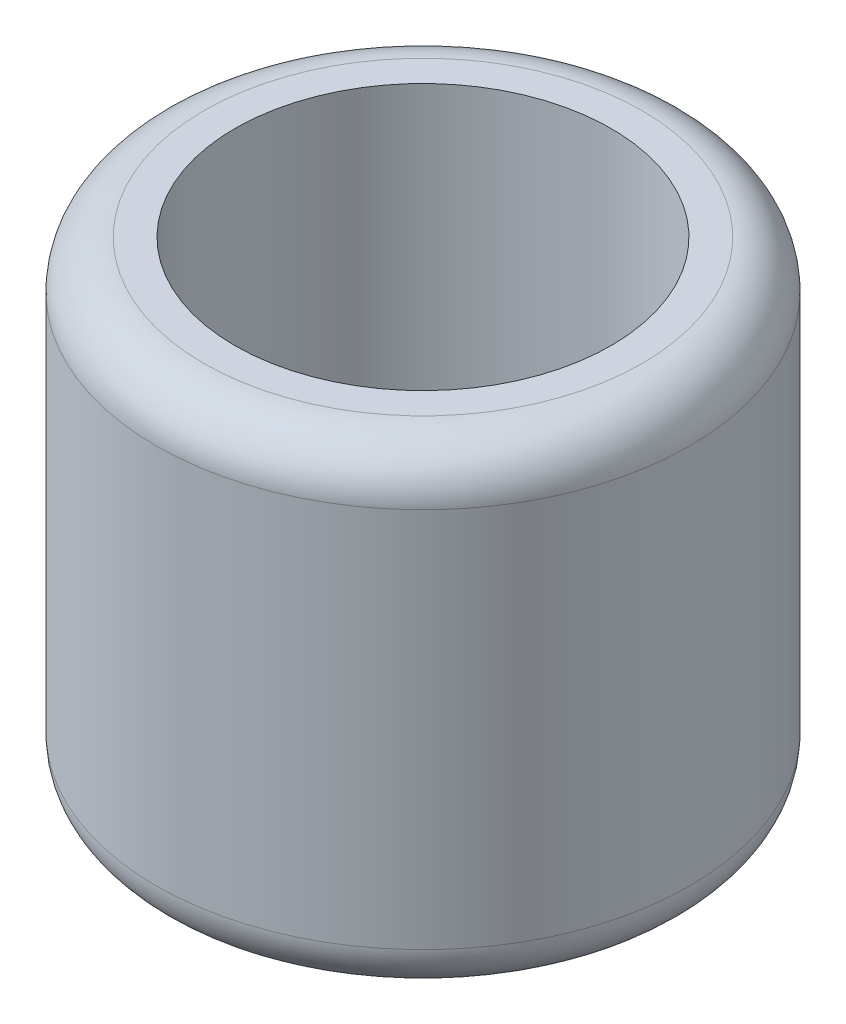
ISO-10303-21;
HEADER;
FILE_DESCRIPTION(('STEP AP214'),'2;1');
FILE_NAME('part.step','',(''),(''),'','','');
FILE_SCHEMA(('AUTOMOTIVE_DESIGN { 1 0 10303 214 1 1 1 1 }'));
ENDSEC;
DATA;
#1=APPLICATION_CONTEXT('core data for automotive mechanical design processes');
#2=APPLICATION_PROTOCOL_DEFINITION('international standard','automotive_design',2000,#1);
#3=PRODUCT_CONTEXT('',#1,'mechanical');
#4=PRODUCT('Part','Part','',(#3));
#5=PRODUCT_RELATED_PRODUCT_CATEGORY('part','',(#4));
#6=PRODUCT_DEFINITION_FORMATION('','',#4);
#7=PRODUCT_DEFINITION_CONTEXT('part definition',#1,'design');
#8=PRODUCT_DEFINITION('design','',#6,#7);
#9=PRODUCT_DEFINITION_SHAPE('','',#8);
#10=(LENGTH_UNIT() NAMED_UNIT(*) SI_UNIT(.MILLI.,.METRE.));
#11=(NAMED_UNIT(*) PLANE_ANGLE_UNIT() SI_UNIT($,.RADIAN.));
#12=(NAMED_UNIT(*) SI_UNIT($,.STERADIAN.) SOLID_ANGLE_UNIT());
#13=UNCERTAINTY_MEASURE_WITH_UNIT(LENGTH_MEASURE(1.E-05),#10,'distance_accuracy_value','');
#14=(GEOMETRIC_REPRESENTATION_CONTEXT(3) GLOBAL_UNCERTAINTY_ASSIGNED_CONTEXT((#13)) GLOBAL_UNIT_ASSIGNED_CONTEXT((#10,
#11,#12)) REPRESENTATION_CONTEXT('',''));
#15=CARTESIAN_POINT('',(0.,0.,0.));
#16=DIRECTION('',(0.,0.,1.));
#17=DIRECTION('',(1.,0.,0.));
#18=AXIS2_PLACEMENT_3D('',#15,#16,#17);
#19=CARTESIAN_POINT('',(0.,10.,0.));
#20=DIRECTION('',(0.,1.,0.));
#21=DIRECTION('',(0.,0.,1.));
#22=AXIS2_PLACEMENT_3D('',#19,#20,#21);
#23=PLANE('',#22);
#24=CARTESIAN_POINT('',(0.,10.,0.));
#25=DIRECTION('',(0.,1.,0.));
#26=DIRECTION('',(0.,0.,1.));
#27=AXIS2_PLACEMENT_3D('',#24,#25,#26);
#28=CIRCLE('',#27,4.6);
#29=CARTESIAN_POINT('',(0.,10.,4.6));
#30=VERTEX_POINT('',#29);
#31=EDGE_CURVE('E10',#30,#30,#28,.T.);
#32=ORIENTED_EDGE('',*,*,#31,.T.);
#33=EDGE_LOOP('',(#32));
#34=FACE_BOUND('',#33,.T.);
#35=CARTESIAN_POINT('',(0.,10.,0.));
#36=DIRECTION('',(0.,1.,0.));
#37=DIRECTION('',(0.,0.,1.));
#38=AXIS2_PLACEMENT_3D('',#35,#36,#37);
#39=CIRCLE('',#38,3.95);
#40=CARTESIAN_POINT('',(0.,10.,3.95));
#41=VERTEX_POINT('',#40);
#42=EDGE_CURVE('E51',#41,#41,#39,.T.);
#43=ORIENTED_EDGE('',*,*,#42,.F.);
#44=EDGE_LOOP('',(#43));
#45=FACE_BOUND('',#44,.T.);
#46=ADVANCED_FACE('F31',(#34,#45),#23,.T.);
#47=CARTESIAN_POINT('',(0.,0.,0.));
#48=DIRECTION('',(0.,1.,0.));
#49=DIRECTION('',(0.,0.,1.));
#50=AXIS2_PLACEMENT_3D('',#47,#48,#49);
#51=PLANE('',#50);
#52=CARTESIAN_POINT('',(0.,0.,0.));
#53=DIRECTION('',(0.,1.,0.));
#54=DIRECTION('',(0.,0.,1.));
#55=AXIS2_PLACEMENT_3D('',#52,#53,#54);
#56=CIRCLE('',#55,4.6);
#57=CARTESIAN_POINT('',(0.,0.,4.6));
#58=VERTEX_POINT('',#57);
#59=EDGE_CURVE('E38',#58,#58,#56,.F.);
#60=ORIENTED_EDGE('',*,*,#59,.T.);
#61=EDGE_LOOP('',(#60));
#62=FACE_BOUND('',#61,.T.);
#63=CARTESIAN_POINT('',(0.,0.,0.));
#64=DIRECTION('',(0.,1.,0.));
#65=DIRECTION('',(0.,0.,1.));
#66=AXIS2_PLACEMENT_3D('',#63,#64,#65);
#67=CIRCLE('',#66,3.95);
#68=CARTESIAN_POINT('',(0.,0.,3.95));
#69=VERTEX_POINT('',#68);
#70=EDGE_CURVE('E52',#69,#69,#67,.T.);
#71=ORIENTED_EDGE('',*,*,#70,.T.);
#72=EDGE_LOOP('',(#71));
#73=FACE_BOUND('',#72,.T.);
#74=ADVANCED_FACE('F62',(#62,#73),#51,.F.);
#75=CARTESIAN_POINT('',(0.,10.,0.));
#76=DIRECTION('',(0.,-1.,0.));
#77=DIRECTION('',(0.,0.,-1.));
#78=AXIS2_PLACEMENT_3D('',#75,#76,#77);
#79=CYLINDRICAL_SURFACE('',#78,5.6);
#80=CARTESIAN_POINT('',(0.,0.999999999999999,0.));
#81=DIRECTION('',(0.,1.,0.));
#82=DIRECTION('',(0.,0.,1.));
#83=AXIS2_PLACEMENT_3D('',#80,#81,#82);
#84=CIRCLE('',#83,5.6);
#85=CARTESIAN_POINT('',(0.,0.999999999999999,5.6));
#86=VERTEX_POINT('',#85);
#87=EDGE_CURVE('E42',#86,#86,#84,.T.);
#88=ORIENTED_EDGE('',*,*,#87,.T.);
#89=EDGE_LOOP('',(#88));
#90=FACE_BOUND('',#89,.T.);
#91=CARTESIAN_POINT('',(0.,9.,0.));
#92=DIRECTION('',(0.,1.,0.));
#93=DIRECTION('',(0.,0.,1.));
#94=AXIS2_PLACEMENT_3D('',#91,#92,#93);
#95=CIRCLE('',#94,5.6);
#96=CARTESIAN_POINT('',(0.,9.,5.6));
#97=VERTEX_POINT('',#96);
#98=EDGE_CURVE('E46',#97,#97,#95,.F.);
#99=ORIENTED_EDGE('',*,*,#98,.T.);
#100=EDGE_LOOP('',(#99));
#101=FACE_BOUND('',#100,.T.);
#102=ADVANCED_FACE('F67',(#90,#101),#79,.T.);
#103=CARTESIAN_POINT('',(0.,10.,0.));
#104=DIRECTION('',(0.,-1.,0.));
#105=DIRECTION('',(0.,0.,-1.));
#106=AXIS2_PLACEMENT_3D('',#103,#104,#105);
#107=CYLINDRICAL_SURFACE('',#106,3.95);
#108=ORIENTED_EDGE('',*,*,#42,.T.);
#109=EDGE_LOOP('',(#108));
#110=FACE_BOUND('',#109,.T.);
#111=ORIENTED_EDGE('',*,*,#70,.F.);
#112=EDGE_LOOP('',(#111));
#113=FACE_BOUND('',#112,.T.);
#114=ADVANCED_FACE('F58',(#110,#113),#107,.F.);
#115=CARTESIAN_POINT('',(0.,0.999999999999999,0.));
#116=DIRECTION('',(0.,1.,0.));
#117=DIRECTION('',(0.,0.,1.));
#118=AXIS2_PLACEMENT_3D('',#115,#116,#117);
#119=TOROIDAL_SURFACE('',#118,4.6,1.);
#120=ORIENTED_EDGE('',*,*,#59,.F.);
#121=EDGE_LOOP('',(#120));
#122=FACE_BOUND('',#121,.T.);
#123=ORIENTED_EDGE('',*,*,#87,.F.);
#124=EDGE_LOOP('',(#123));
#125=FACE_BOUND('',#124,.T.);
#126=ADVANCED_FACE('F73',(#122,#125),#119,.T.);
#127=CARTESIAN_POINT('',(0.,9.,0.));
#128=DIRECTION('',(0.,1.,0.));
#129=DIRECTION('',(0.,0.,1.));
#130=AXIS2_PLACEMENT_3D('',#127,#128,#129);
#131=TOROIDAL_SURFACE('',#130,4.6,1.);
#132=ORIENTED_EDGE('',*,*,#98,.F.);
#133=EDGE_LOOP('',(#132));
#134=FACE_BOUND('',#133,.T.);
#135=ORIENTED_EDGE('',*,*,#31,.F.);
#136=EDGE_LOOP('',(#135));
#137=FACE_BOUND('',#136,.T.);
#138=ADVANCED_FACE('F33',(#134,#137),#131,.T.);
#139=CLOSED_SHELL('',(#46,#74,#102,#114,#126,#138));
#140=MANIFOLD_SOLID_BREP('B2',#139);
#141=ADVANCED_BREP_SHAPE_REPRESENTATION('',(#18,#140),#14);
#142=SHAPE_DEFINITION_REPRESENTATION(#9,#141);
ENDSEC;
END-ISO-10303-21;
